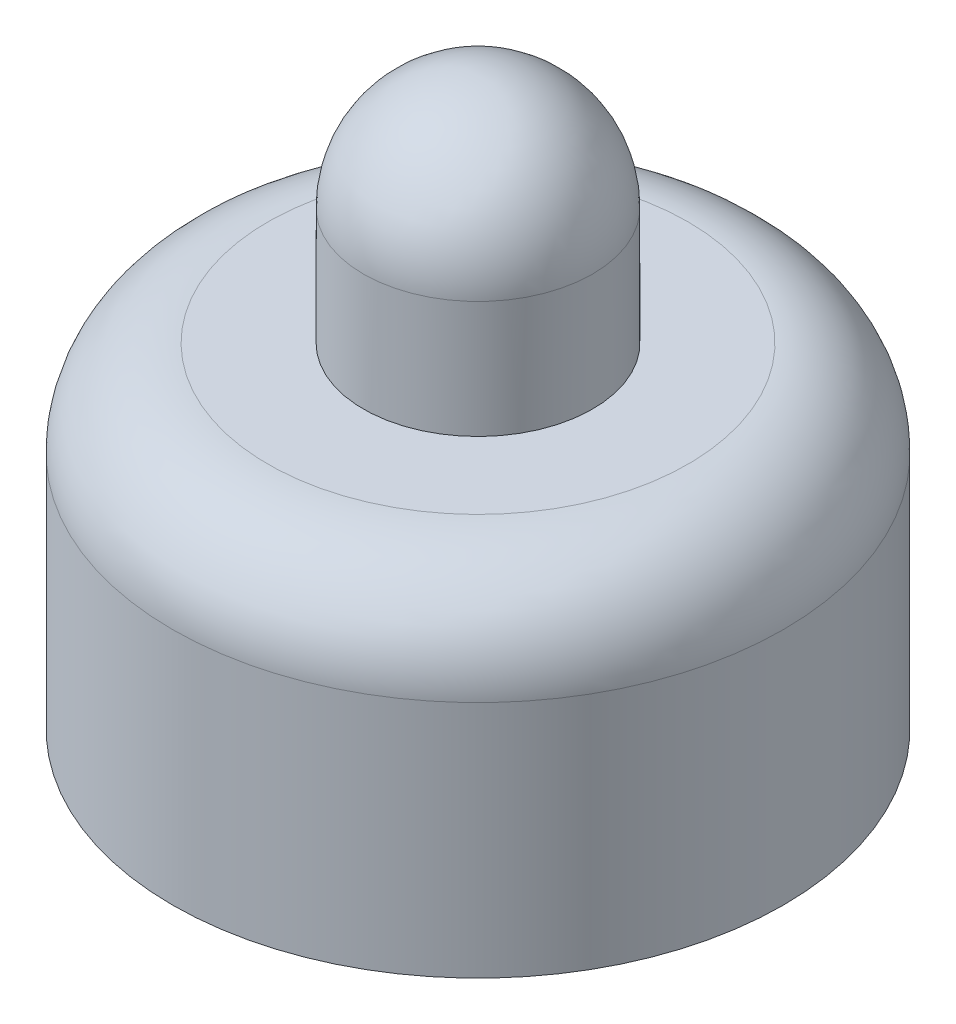
ISO-10303-21;
HEADER;
FILE_DESCRIPTION(('STEP AP214'),'2;1');
FILE_NAME('part.step','',(''),(''),'','','');
FILE_SCHEMA(('AUTOMOTIVE_DESIGN { 1 0 10303 214 1 1 1 1 }'));
ENDSEC;
DATA;
#1=APPLICATION_CONTEXT('core data for automotive mechanical design processes');
#2=APPLICATION_PROTOCOL_DEFINITION('international standard','automotive_design',2000,#1);
#3=PRODUCT_CONTEXT('',#1,'mechanical');
#4=PRODUCT('Part','Part','',(#3));
#5=PRODUCT_RELATED_PRODUCT_CATEGORY('part','',(#4));
#6=PRODUCT_DEFINITION_FORMATION('','',#4);
#7=PRODUCT_DEFINITION_CONTEXT('part definition',#1,'design');
#8=PRODUCT_DEFINITION('design','',#6,#7);
#9=PRODUCT_DEFINITION_SHAPE('','',#8);
#10=(LENGTH_UNIT() NAMED_UNIT(*) SI_UNIT(.MILLI.,.METRE.));
#11=(NAMED_UNIT(*) PLANE_ANGLE_UNIT() SI_UNIT($,.RADIAN.));
#12=(NAMED_UNIT(*) SI_UNIT($,.STERADIAN.) SOLID_ANGLE_UNIT());
#13=UNCERTAINTY_MEASURE_WITH_UNIT(LENGTH_MEASURE(1.E-05),#10,'distance_accuracy_value','');
#14=(GEOMETRIC_REPRESENTATION_CONTEXT(3) GLOBAL_UNCERTAINTY_ASSIGNED_CONTEXT((#13)) GLOBAL_UNIT_ASSIGNED_CONTEXT((#10,
#11,#12)) REPRESENTATION_CONTEXT('',''));
#15=CARTESIAN_POINT('',(0.,0.,0.));
#16=DIRECTION('',(0.,0.,1.));
#17=DIRECTION('',(1.,0.,0.));
#18=AXIS2_PLACEMENT_3D('',#15,#16,#17);
#19=CARTESIAN_POINT('',(0.,0.,0.));
#20=DIRECTION('',(0.,-1.,0.));
#21=DIRECTION('',(0.,0.,-1.));
#22=AXIS2_PLACEMENT_3D('',#19,#20,#21);
#23=CYLINDRICAL_SURFACE('',#22,2.4);
#24=CARTESIAN_POINT('',(0.,14.3357142857143,0.));
#25=DIRECTION('',(0.,-1.,0.));
#26=DIRECTION('',(0.,0.,-1.));
#27=AXIS2_PLACEMENT_3D('',#24,#25,#26);
#28=CIRCLE('',#27,2.4);
#29=CARTESIAN_POINT('',(0.,14.3357142857143,-2.4));
#30=VERTEX_POINT('',#29);
#31=EDGE_CURVE('E58',#30,#30,#28,.T.);
#32=ORIENTED_EDGE('',*,*,#31,.F.);
#33=EDGE_LOOP('',(#32));
#34=FACE_BOUND('',#33,.T.);
#35=CARTESIAN_POINT('',(0.,16.7857142857143,0.));
#36=DIRECTION('',(0.,-1.,0.));
#37=DIRECTION('',(0.,0.,-1.));
#38=AXIS2_PLACEMENT_3D('',#35,#36,#37);
#39=CIRCLE('',#38,2.4);
#40=CARTESIAN_POINT('',(0.,16.7857142857143,-2.4));
#41=VERTEX_POINT('',#40);
#42=EDGE_CURVE('E49',#41,#41,#39,.T.);
#43=ORIENTED_EDGE('',*,*,#42,.T.);
#44=EDGE_LOOP('',(#43));
#45=FACE_BOUND('',#44,.T.);
#46=ADVANCED_FACE('F38',(#34,#45),#23,.T.);
#47=CARTESIAN_POINT('',(0.,16.7857142857143,0.));
#48=DIRECTION('',(0.,-1.,0.));
#49=DIRECTION('',(1.,0.,0.));
#50=AXIS2_PLACEMENT_3D('',#47,#48,#49);
#51=SPHERICAL_SURFACE('',#50,2.4);
#52=ORIENTED_EDGE('',*,*,#42,.F.);
#53=EDGE_LOOP('',(#52));
#54=FACE_BOUND('',#53,.T.);
#55=ADVANCED_FACE('F66',(#54),#51,.T.);
#56=CARTESIAN_POINT('',(0.,7.33571428571428,0.));
#57=DIRECTION('',(0.,1.,0.));
#58=DIRECTION('',(0.,0.,1.));
#59=AXIS2_PLACEMENT_3D('',#56,#57,#58);
#60=PLANE('',#59);
#61=CARTESIAN_POINT('',(0.,7.33571428571428,0.));
#62=DIRECTION('',(0.,-1.,0.));
#63=DIRECTION('',(0.,0.,-1.));
#64=AXIS2_PLACEMENT_3D('',#61,#62,#63);
#65=CIRCLE('',#64,6.4);
#66=CARTESIAN_POINT('',(0.,7.33571428571428,-6.4));
#67=VERTEX_POINT('',#66);
#68=EDGE_CURVE('E53',#67,#67,#65,.T.);
#69=ORIENTED_EDGE('',*,*,#68,.T.);
#70=EDGE_LOOP('',(#69));
#71=FACE_BOUND('',#70,.T.);
#72=ADVANCED_FACE('F70',(#71),#60,.F.);
#73=CARTESIAN_POINT('',(0.,0.,0.));
#74=DIRECTION('',(0.,-1.,0.));
#75=DIRECTION('',(0.,0.,-1.));
#76=AXIS2_PLACEMENT_3D('',#73,#74,#75);
#77=CYLINDRICAL_SURFACE('',#76,6.4);
#78=CARTESIAN_POINT('',(0.,12.3357142857143,0.));
#79=DIRECTION('',(0.,-1.,0.));
#80=DIRECTION('',(0.,0.,-1.));
#81=AXIS2_PLACEMENT_3D('',#78,#79,#80);
#82=CIRCLE('',#81,6.4);
#83=CARTESIAN_POINT('',(0.,12.3357142857143,-6.4));
#84=VERTEX_POINT('',#83);
#85=EDGE_CURVE('E45',#84,#84,#82,.T.);
#86=ORIENTED_EDGE('',*,*,#85,.T.);
#87=EDGE_LOOP('',(#86));
#88=FACE_BOUND('',#87,.T.);
#89=ORIENTED_EDGE('',*,*,#68,.F.);
#90=EDGE_LOOP('',(#89));
#91=FACE_BOUND('',#90,.T.);
#92=ADVANCED_FACE('F75',(#88,#91),#77,.T.);
#93=CARTESIAN_POINT('',(0.,14.3357142857143,0.));
#94=DIRECTION('',(0.,-1.,0.));
#95=DIRECTION('',(0.,0.,-1.));
#96=AXIS2_PLACEMENT_3D('',#93,#94,#95);
#97=PLANE('',#96);
#98=CARTESIAN_POINT('',(0.,14.3357142857143,0.));
#99=DIRECTION('',(0.,-1.,0.));
#100=DIRECTION('',(0.,0.,-1.));
#101=AXIS2_PLACEMENT_3D('',#98,#99,#100);
#102=CIRCLE('',#101,4.4);
#103=CARTESIAN_POINT('',(0.,14.3357142857143,-4.4));
#104=VERTEX_POINT('',#103);
#105=EDGE_CURVE('E10',#104,#104,#102,.F.);
#106=ORIENTED_EDGE('',*,*,#105,.T.);
#107=EDGE_LOOP('',(#106));
#108=FACE_BOUND('',#107,.T.);
#109=ORIENTED_EDGE('',*,*,#31,.T.);
#110=EDGE_LOOP('',(#109));
#111=FACE_BOUND('',#110,.T.);
#112=ADVANCED_FACE('F62',(#108,#111),#97,.F.);
#113=CARTESIAN_POINT('',(0.,12.3357142857143,0.));
#114=DIRECTION('',(0.,-1.,0.));
#115=DIRECTION('',(0.,0.,-1.));
#116=AXIS2_PLACEMENT_3D('',#113,#114,#115);
#117=TOROIDAL_SURFACE('',#116,4.4,2.);
#118=ORIENTED_EDGE('',*,*,#105,.F.);
#119=EDGE_LOOP('',(#118));
#120=FACE_BOUND('',#119,.T.);
#121=ORIENTED_EDGE('',*,*,#85,.F.);
#122=EDGE_LOOP('',(#121));
#123=FACE_BOUND('',#122,.T.);
#124=ADVANCED_FACE('F40',(#120,#123),#117,.T.);
#125=CLOSED_SHELL('',(#46,#55,#72,#92,#112,#124));
#126=MANIFOLD_SOLID_BREP('B2',#125);
#127=ADVANCED_BREP_SHAPE_REPRESENTATION('',(#18,#126),#14);
#128=SHAPE_DEFINITION_REPRESENTATION(#9,#127);
ENDSEC;
END-ISO-10303-21;
